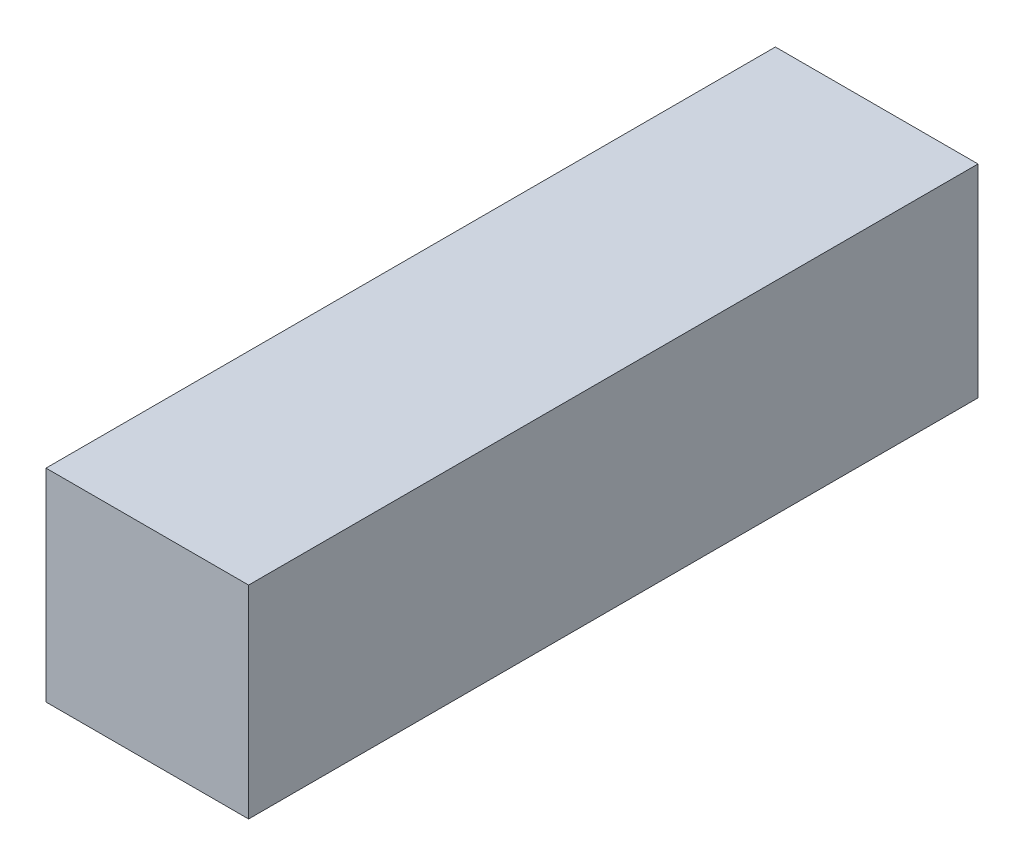
ISO-10303-21;
HEADER;
FILE_DESCRIPTION(('STEP AP214'),'2;1');
FILE_NAME('part.step','',(''),(''),'','','');
FILE_SCHEMA(('AUTOMOTIVE_DESIGN { 1 0 10303 214 1 1 1 1 }'));
ENDSEC;
DATA;
#1=APPLICATION_CONTEXT('core data for automotive mechanical design processes');
#2=APPLICATION_PROTOCOL_DEFINITION('international standard','automotive_design',2000,#1);
#3=PRODUCT_CONTEXT('',#1,'mechanical');
#4=PRODUCT('Part','Part','',(#3));
#5=PRODUCT_RELATED_PRODUCT_CATEGORY('part','',(#4));
#6=PRODUCT_DEFINITION_FORMATION('','',#4);
#7=PRODUCT_DEFINITION_CONTEXT('part definition',#1,'design');
#8=PRODUCT_DEFINITION('design','',#6,#7);
#9=PRODUCT_DEFINITION_SHAPE('','',#8);
#10=(LENGTH_UNIT() NAMED_UNIT(*) SI_UNIT(.MILLI.,.METRE.));
#11=(NAMED_UNIT(*) PLANE_ANGLE_UNIT() SI_UNIT($,.RADIAN.));
#12=(NAMED_UNIT(*) SI_UNIT($,.STERADIAN.) SOLID_ANGLE_UNIT());
#13=UNCERTAINTY_MEASURE_WITH_UNIT(LENGTH_MEASURE(1.E-05),#10,'distance_accuracy_value','');
#14=(GEOMETRIC_REPRESENTATION_CONTEXT(3) GLOBAL_UNCERTAINTY_ASSIGNED_CONTEXT((#13)) GLOBAL_UNIT_ASSIGNED_CONTEXT((#10,
#11,#12)) REPRESENTATION_CONTEXT('',''));
#15=CARTESIAN_POINT('',(0.,0.,0.));
#16=DIRECTION('',(0.,0.,1.));
#17=DIRECTION('',(1.,0.,0.));
#18=AXIS2_PLACEMENT_3D('',#15,#16,#17);
#19=CARTESIAN_POINT('',(-167.893120649168,18.6708860759494,180.));
#20=DIRECTION('',(1.,0.,0.));
#21=DIRECTION('',(0.,0.,-1.));
#22=AXIS2_PLACEMENT_3D('',#19,#20,#21);
#23=PLANE('',#22);
#24=DIRECTION('',(0.,-1.,0.));
#25=VECTOR('',#24,1.);
#26=CARTESIAN_POINT('',(-167.893120649168,18.6708860759494,0.));
#27=LINE('',#26,#25);
#28=CARTESIAN_POINT('',(-167.893120649168,18.6708860759494,0.));
#29=VERTEX_POINT('',#28);
#30=CARTESIAN_POINT('',(-167.893120649168,-31.3291139240506,0.));
#31=VERTEX_POINT('',#30);
#32=EDGE_CURVE('E107',#29,#31,#27,.T.);
#33=ORIENTED_EDGE('',*,*,#32,.T.);
#34=DIRECTION('',(0.,0.,-1.));
#35=VECTOR('',#34,1.);
#36=CARTESIAN_POINT('',(-167.893120649168,-31.3291139240506,180.));
#37=LINE('',#36,#35);
#38=CARTESIAN_POINT('',(-167.893120649168,-31.3291139240506,180.));
#39=VERTEX_POINT('',#38);
#40=EDGE_CURVE('E11',#39,#31,#37,.T.);
#41=ORIENTED_EDGE('',*,*,#40,.F.);
#42=DIRECTION('',(0.,-1.,0.));
#43=VECTOR('',#42,1.);
#44=CARTESIAN_POINT('',(-167.893120649168,18.6708860759494,180.));
#45=LINE('',#44,#43);
#46=CARTESIAN_POINT('',(-167.893120649168,18.6708860759494,180.));
#47=VERTEX_POINT('',#46);
#48=EDGE_CURVE('E91',#47,#39,#45,.T.);
#49=ORIENTED_EDGE('',*,*,#48,.F.);
#50=DIRECTION('',(0.,0.,-1.));
#51=VECTOR('',#50,1.);
#52=CARTESIAN_POINT('',(-167.893120649168,18.6708860759494,180.));
#53=LINE('',#52,#51);
#54=EDGE_CURVE('E103',#47,#29,#53,.T.);
#55=ORIENTED_EDGE('',*,*,#54,.T.);
#56=EDGE_LOOP('',(#33,#41,#49,#55));
#57=FACE_BOUND('',#56,.T.);
#58=ADVANCED_FACE('F39',(#57),#23,.F.);
#59=CARTESIAN_POINT('',(-167.893120649168,-31.3291139240506,180.));
#60=DIRECTION('',(0.,1.,0.));
#61=DIRECTION('',(0.,0.,1.));
#62=AXIS2_PLACEMENT_3D('',#59,#60,#61);
#63=PLANE('',#62);
#64=DIRECTION('',(1.,0.,0.));
#65=VECTOR('',#64,1.);
#66=CARTESIAN_POINT('',(-167.893120649168,-31.3291139240506,0.));
#67=LINE('',#66,#65);
#68=CARTESIAN_POINT('',(-117.893120649168,-31.3291139240506,0.));
#69=VERTEX_POINT('',#68);
#70=EDGE_CURVE('E96',#31,#69,#67,.T.);
#71=ORIENTED_EDGE('',*,*,#70,.T.);
#72=DIRECTION('',(0.,0.,-1.));
#73=VECTOR('',#72,1.);
#74=CARTESIAN_POINT('',(-117.893120649168,-31.3291139240506,180.));
#75=LINE('',#74,#73);
#76=CARTESIAN_POINT('',(-117.893120649168,-31.3291139240506,180.));
#77=VERTEX_POINT('',#76);
#78=EDGE_CURVE('E48',#77,#69,#75,.T.);
#79=ORIENTED_EDGE('',*,*,#78,.F.);
#80=DIRECTION('',(1.,0.,0.));
#81=VECTOR('',#80,1.);
#82=CARTESIAN_POINT('',(-167.893120649168,-31.3291139240506,180.));
#83=LINE('',#82,#81);
#84=EDGE_CURVE('E86',#39,#77,#83,.T.);
#85=ORIENTED_EDGE('',*,*,#84,.F.);
#86=ORIENTED_EDGE('',*,*,#40,.T.);
#87=EDGE_LOOP('',(#71,#79,#85,#86));
#88=FACE_BOUND('',#87,.T.);
#89=ADVANCED_FACE('F95',(#88),#63,.F.);
#90=CARTESIAN_POINT('',(-117.893120649168,18.6708860759494,180.));
#91=DIRECTION('',(-1.,0.,0.));
#92=DIRECTION('',(0.,0.,1.));
#93=AXIS2_PLACEMENT_3D('',#90,#91,#92);
#94=PLANE('',#93);
#95=DIRECTION('',(0.,1.,0.));
#96=VECTOR('',#95,1.);
#97=CARTESIAN_POINT('',(-117.893120649168,18.6708860759494,0.));
#98=LINE('',#97,#96);
#99=CARTESIAN_POINT('',(-117.893120649168,18.6708860759494,0.));
#100=VERTEX_POINT('',#99);
#101=EDGE_CURVE('E73',#69,#100,#98,.T.);
#102=ORIENTED_EDGE('',*,*,#101,.T.);
#103=DIRECTION('',(0.,0.,-1.));
#104=VECTOR('',#103,1.);
#105=CARTESIAN_POINT('',(-117.893120649168,18.6708860759494,180.));
#106=LINE('',#105,#104);
#107=CARTESIAN_POINT('',(-117.893120649168,18.6708860759494,180.));
#108=VERTEX_POINT('',#107);
#109=EDGE_CURVE('E98',#108,#100,#106,.T.);
#110=ORIENTED_EDGE('',*,*,#109,.F.);
#111=DIRECTION('',(0.,1.,0.));
#112=VECTOR('',#111,1.);
#113=CARTESIAN_POINT('',(-117.893120649168,18.6708860759494,180.));
#114=LINE('',#113,#112);
#115=EDGE_CURVE('E89',#77,#108,#114,.T.);
#116=ORIENTED_EDGE('',*,*,#115,.F.);
#117=ORIENTED_EDGE('',*,*,#78,.T.);
#118=EDGE_LOOP('',(#102,#110,#116,#117));
#119=FACE_BOUND('',#118,.T.);
#120=ADVANCED_FACE('F99',(#119),#94,.F.);
#121=CARTESIAN_POINT('',(-167.893120649168,18.6708860759494,180.));
#122=DIRECTION('',(0.,-1.,0.));
#123=DIRECTION('',(0.,0.,-1.));
#124=AXIS2_PLACEMENT_3D('',#121,#122,#123);
#125=PLANE('',#124);
#126=DIRECTION('',(-1.,0.,0.));
#127=VECTOR('',#126,1.);
#128=CARTESIAN_POINT('',(-167.893120649168,18.6708860759494,0.));
#129=LINE('',#128,#127);
#130=EDGE_CURVE('E79',#100,#29,#129,.T.);
#131=ORIENTED_EDGE('',*,*,#130,.T.);
#132=ORIENTED_EDGE('',*,*,#54,.F.);
#133=DIRECTION('',(-1.,0.,0.));
#134=VECTOR('',#133,1.);
#135=CARTESIAN_POINT('',(-167.893120649168,18.6708860759494,180.));
#136=LINE('',#135,#134);
#137=EDGE_CURVE('E56',#108,#47,#136,.T.);
#138=ORIENTED_EDGE('',*,*,#137,.F.);
#139=ORIENTED_EDGE('',*,*,#109,.T.);
#140=EDGE_LOOP('',(#131,#132,#138,#139));
#141=FACE_BOUND('',#140,.T.);
#142=ADVANCED_FACE('F120',(#141),#125,.F.);
#143=CARTESIAN_POINT('',(0.,0.,180.));
#144=DIRECTION('',(0.,0.,1.));
#145=DIRECTION('',(1.,0.,0.));
#146=AXIS2_PLACEMENT_3D('',#143,#144,#145);
#147=PLANE('',#146);
#148=ORIENTED_EDGE('',*,*,#48,.T.);
#149=ORIENTED_EDGE('',*,*,#84,.T.);
#150=ORIENTED_EDGE('',*,*,#115,.T.);
#151=ORIENTED_EDGE('',*,*,#137,.T.);
#152=EDGE_LOOP('',(#148,#149,#150,#151));
#153=FACE_BOUND('',#152,.T.);
#154=ADVANCED_FACE('F87',(#153),#147,.T.);
#155=CARTESIAN_POINT('',(0.,0.,0.));
#156=DIRECTION('',(0.,0.,1.));
#157=DIRECTION('',(1.,0.,0.));
#158=AXIS2_PLACEMENT_3D('',#155,#156,#157);
#159=PLANE('',#158);
#160=ORIENTED_EDGE('',*,*,#32,.F.);
#161=ORIENTED_EDGE('',*,*,#130,.F.);
#162=ORIENTED_EDGE('',*,*,#101,.F.);
#163=ORIENTED_EDGE('',*,*,#70,.F.);
#164=EDGE_LOOP('',(#160,#161,#162,#163));
#165=FACE_BOUND('',#164,.T.);
#166=ADVANCED_FACE('F123',(#165),#159,.F.);
#167=CLOSED_SHELL('',(#58,#89,#120,#142,#154,#166));
#168=MANIFOLD_SOLID_BREP('B2',#167);
#169=ADVANCED_BREP_SHAPE_REPRESENTATION('',(#18,#168),#14);
#170=SHAPE_DEFINITION_REPRESENTATION(#9,#169);
ENDSEC;
END-ISO-10303-21;
